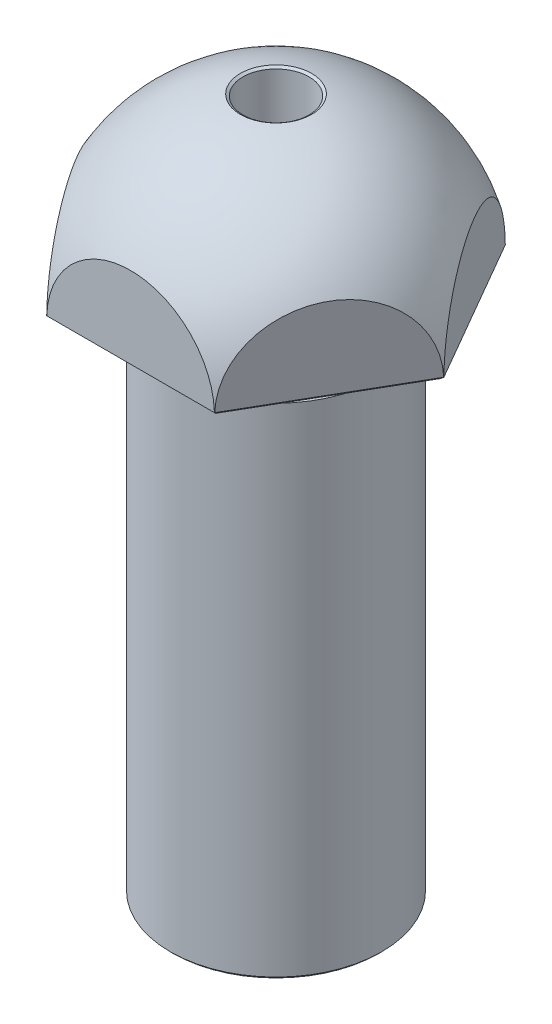
ISO-10303-21;
HEADER;
FILE_DESCRIPTION(('STEP AP214'),'2;1');
FILE_NAME('part.step','',(''),(''),'','','');
FILE_SCHEMA(('AUTOMOTIVE_DESIGN { 1 0 10303 214 1 1 1 1 }'));
ENDSEC;
DATA;
#1=APPLICATION_CONTEXT('core data for automotive mechanical design processes');
#2=APPLICATION_PROTOCOL_DEFINITION('international standard','automotive_design',2000,#1);
#3=PRODUCT_CONTEXT('',#1,'mechanical');
#4=PRODUCT('Part','Part','',(#3));
#5=PRODUCT_RELATED_PRODUCT_CATEGORY('part','',(#4));
#6=PRODUCT_DEFINITION_FORMATION('','',#4);
#7=PRODUCT_DEFINITION_CONTEXT('part definition',#1,'design');
#8=PRODUCT_DEFINITION('design','',#6,#7);
#9=PRODUCT_DEFINITION_SHAPE('','',#8);
#10=(LENGTH_UNIT() NAMED_UNIT(*) SI_UNIT(.MILLI.,.METRE.));
#11=(NAMED_UNIT(*) PLANE_ANGLE_UNIT() SI_UNIT($,.RADIAN.));
#12=(NAMED_UNIT(*) SI_UNIT($,.STERADIAN.) SOLID_ANGLE_UNIT());
#13=UNCERTAINTY_MEASURE_WITH_UNIT(LENGTH_MEASURE(1.E-05),#10,'distance_accuracy_value','');
#14=(GEOMETRIC_REPRESENTATION_CONTEXT(3) GLOBAL_UNCERTAINTY_ASSIGNED_CONTEXT((#13)) GLOBAL_UNIT_ASSIGNED_CONTEXT((#10,
#11,#12)) REPRESENTATION_CONTEXT('',''));
#15=CARTESIAN_POINT('',(0.,0.,0.));
#16=DIRECTION('',(0.,0.,1.));
#17=DIRECTION('',(1.,0.,0.));
#18=AXIS2_PLACEMENT_3D('',#15,#16,#17);
#19=CARTESIAN_POINT('',(0.,0.,0.));
#20=DIRECTION('',(0.,-1.,0.));
#21=DIRECTION('',(0.,0.,-1.));
#22=AXIS2_PLACEMENT_3D('',#19,#20,#21);
#23=CYLINDRICAL_SURFACE('',#22,2.49999999999999);
#24=CARTESIAN_POINT('',(0.,52.2816233799582,0.));
#25=DIRECTION('',(0.,1.,0.));
#26=DIRECTION('',(0.,0.,1.));
#27=AXIS2_PLACEMENT_3D('',#24,#25,#26);
#28=CIRCLE('',#27,2.49999999999999);
#29=CARTESIAN_POINT('',(0.,52.2816233799582,2.49999999999999));
#30=VERTEX_POINT('',#29);
#31=EDGE_CURVE('E142',#30,#30,#28,.T.);
#32=ORIENTED_EDGE('',*,*,#31,.T.);
#33=EDGE_LOOP('',(#32));
#34=FACE_BOUND('',#33,.T.);
#35=CARTESIAN_POINT('',(0.,27.,0.));
#36=DIRECTION('',(0.,-1.,0.));
#37=DIRECTION('',(0.,0.,-1.));
#38=AXIS2_PLACEMENT_3D('',#35,#36,#37);
#39=CIRCLE('',#38,2.49999999999999);
#40=CARTESIAN_POINT('',(0.,27.,-2.49999999999999));
#41=VERTEX_POINT('',#40);
#42=EDGE_CURVE('E11',#41,#41,#39,.F.);
#43=ORIENTED_EDGE('',*,*,#42,.F.);
#44=EDGE_LOOP('',(#43));
#45=FACE_BOUND('',#44,.T.);
#46=ADVANCED_FACE('F36',(#34,#45),#23,.F.);
#47=CARTESIAN_POINT('',(0.,0.,0.));
#48=DIRECTION('',(0.,-1.,0.));
#49=DIRECTION('',(0.,0.,-1.));
#50=AXIS2_PLACEMENT_3D('',#47,#48,#49);
#51=PLANE('',#50);
#52=CARTESIAN_POINT('',(0.,0.,0.));
#53=DIRECTION('',(0.,-1.,0.));
#54=DIRECTION('',(0.,0.,-1.));
#55=AXIS2_PLACEMENT_3D('',#52,#53,#54);
#56=CIRCLE('',#55,7.79999999999999);
#57=CARTESIAN_POINT('',(0.,0.,-7.79999999999999));
#58=VERTEX_POINT('',#57);
#59=EDGE_CURVE('E44',#58,#58,#56,.T.);
#60=ORIENTED_EDGE('',*,*,#59,.T.);
#61=EDGE_LOOP('',(#60));
#62=FACE_BOUND('',#61,.T.);
#63=ADVANCED_FACE('F265',(#62),#51,.T.);
#64=CARTESIAN_POINT('',(0.,0.,0.));
#65=DIRECTION('',(0.,-1.,0.));
#66=DIRECTION('',(0.,0.,-1.));
#67=AXIS2_PLACEMENT_3D('',#64,#65,#66);
#68=CYLINDRICAL_SURFACE('',#67,8.);
#69=CARTESIAN_POINT('',(0.,37.8,0.));
#70=DIRECTION('',(0.,1.,0.));
#71=DIRECTION('',(0.,0.,1.));
#72=AXIS2_PLACEMENT_3D('',#69,#70,#71);
#73=CIRCLE('',#72,8.);
#74=CARTESIAN_POINT('',(0.,37.8,8.));
#75=VERTEX_POINT('',#74);
#76=EDGE_CURVE('E199',#75,#75,#73,.F.);
#77=ORIENTED_EDGE('',*,*,#76,.T.);
#78=EDGE_LOOP('',(#77));
#79=FACE_BOUND('',#78,.T.);
#80=CARTESIAN_POINT('',(0.,0.200000000000006,0.));
#81=DIRECTION('',(0.,-1.,0.));
#82=DIRECTION('',(0.,0.,-1.));
#83=AXIS2_PLACEMENT_3D('',#80,#81,#82);
#84=CIRCLE('',#83,8.);
#85=CARTESIAN_POINT('',(0.,0.200000000000006,-8.));
#86=VERTEX_POINT('',#85);
#87=EDGE_CURVE('E134',#86,#86,#84,.F.);
#88=ORIENTED_EDGE('',*,*,#87,.T.);
#89=EDGE_LOOP('',(#88));
#90=FACE_BOUND('',#89,.T.);
#91=ADVANCED_FACE('F270',(#79,#90),#68,.T.);
#92=CARTESIAN_POINT('',(0.,39.,0.));
#93=DIRECTION('',(0.,-1.,0.));
#94=DIRECTION('',(0.,0.,-1.));
#95=AXIS2_PLACEMENT_3D('',#92,#93,#94);
#96=TOROIDAL_SURFACE('',#95,8.,1.);
#97=CARTESIAN_POINT('',(0.,38.0258342613227,0.));
#98=DIRECTION('',(0.,1.,0.));
#99=DIRECTION('',(0.,0.,1.));
#100=AXIS2_PLACEMENT_3D('',#97,#98,#99);
#101=CIRCLE('',#100,7.77416573867742);
#102=CARTESIAN_POINT('',(0.,38.0258342613227,7.77416573867742));
#103=VERTEX_POINT('',#102);
#104=EDGE_CURVE('E202',#103,#103,#101,.T.);
#105=ORIENTED_EDGE('',*,*,#104,.T.);
#106=EDGE_LOOP('',(#105));
#107=FACE_BOUND('',#106,.T.);
#108=CARTESIAN_POINT('',(0.,40.,0.));
#109=DIRECTION('',(0.,-1.,0.));
#110=DIRECTION('',(0.,0.,-1.));
#111=AXIS2_PLACEMENT_3D('',#108,#109,#110);
#112=CIRCLE('',#111,8.);
#113=CARTESIAN_POINT('',(0.,40.,-8.));
#114=VERTEX_POINT('',#113);
#115=EDGE_CURVE('E219',#114,#114,#112,.T.);
#116=ORIENTED_EDGE('',*,*,#115,.T.);
#117=EDGE_LOOP('',(#116));
#118=FACE_BOUND('',#117,.T.);
#119=ADVANCED_FACE('F300',(#107,#118),#96,.F.);
#120=CARTESIAN_POINT('',(8.,40.,0.));
#121=DIRECTION('',(0.,-1.,0.));
#122=DIRECTION('',(0.,0.,-1.));
#123=AXIS2_PLACEMENT_3D('',#120,#121,#122);
#124=PLANE('',#123);
#125=DIRECTION('',(1.,0.,0.));
#126=VECTOR('',#125,1.);
#127=CARTESIAN_POINT('',(6.34744042902334,40.,-10.8));
#128=LINE('',#127,#126);
#129=CARTESIAN_POINT('',(-6.23538290724795,40.,-10.8));
#130=VERTEX_POINT('',#129);
#131=CARTESIAN_POINT('',(6.23538290724795,40.,-10.8));
#132=VERTEX_POINT('',#131);
#133=EDGE_CURVE('E179',#130,#132,#128,.T.);
#134=ORIENTED_EDGE('',*,*,#133,.T.);
#135=DIRECTION('',(0.5,0.,0.866025403784439));
#136=VECTOR('',#135,1.);
#137=CARTESIAN_POINT('',(12.5267945753836,40.,0.097044660542604));
#138=LINE('',#137,#136);
#139=CARTESIAN_POINT('',(12.4707658144959,40.,0.));
#140=VERTEX_POINT('',#139);
#141=EDGE_CURVE('E188',#132,#140,#138,.T.);
#142=ORIENTED_EDGE('',*,*,#141,.T.);
#143=DIRECTION('',(-0.5,0.,0.866025403784439));
#144=VECTOR('',#143,1.);
#145=CARTESIAN_POINT('',(6.17935414636027,40.,10.8970446605426));
#146=LINE('',#145,#144);
#147=CARTESIAN_POINT('',(6.23538290724796,40.,10.8));
#148=VERTEX_POINT('',#147);
#149=EDGE_CURVE('E58',#140,#148,#146,.T.);
#150=ORIENTED_EDGE('',*,*,#149,.T.);
#151=DIRECTION('',(-1.,0.,0.));
#152=VECTOR('',#151,1.);
#153=CARTESIAN_POINT('',(-6.34744042902333,40.,10.8));
#154=LINE('',#153,#152);
#155=CARTESIAN_POINT('',(-6.23538290724795,40.,10.8));
#156=VERTEX_POINT('',#155);
#157=EDGE_CURVE('E185',#148,#156,#154,.T.);
#158=ORIENTED_EDGE('',*,*,#157,.T.);
#159=DIRECTION('',(-0.5,0.,-0.866025403784439));
#160=VECTOR('',#159,1.);
#161=CARTESIAN_POINT('',(-12.5267945753836,40.,-0.0970446605426159));
#162=LINE('',#161,#160);
#163=CARTESIAN_POINT('',(-12.4707658144959,40.,0.));
#164=VERTEX_POINT('',#163);
#165=EDGE_CURVE('E183',#156,#164,#162,.T.);
#166=ORIENTED_EDGE('',*,*,#165,.T.);
#167=DIRECTION('',(0.5,0.,-0.866025403784439));
#168=VECTOR('',#167,1.);
#169=CARTESIAN_POINT('',(-6.17935414636026,40.,-10.8970446605426));
#170=LINE('',#169,#168);
#171=EDGE_CURVE('E181',#164,#130,#170,.T.);
#172=ORIENTED_EDGE('',*,*,#171,.T.);
#173=EDGE_LOOP('',(#134,#142,#150,#158,#166,#172));
#174=FACE_BOUND('',#173,.T.);
#175=ORIENTED_EDGE('',*,*,#115,.F.);
#176=EDGE_LOOP('',(#175));
#177=FACE_BOUND('',#176,.T.);
#178=ADVANCED_FACE('F296',(#174,#177),#124,.T.);
#179=CARTESIAN_POINT('',(0.,40.,0.));
#180=DIRECTION('',(0.,-1.,0.));
#181=DIRECTION('',(1.,0.,0.));
#182=AXIS2_PLACEMENT_3D('',#179,#180,#181);
#183=SPHERICAL_SURFACE('',#182,12.7);
#184=CARTESIAN_POINT('',(0.,52.4109208506476,0.));
#185=DIRECTION('',(0.,-1.,0.));
#186=DIRECTION('',(0.,0.,-1.));
#187=AXIS2_PLACEMENT_3D('',#184,#185,#186);
#188=CIRCLE('',#187,2.69426124178065);
#189=CARTESIAN_POINT('',(0.,52.4109208506476,-2.69426124178065));
#190=VERTEX_POINT('',#189);
#191=EDGE_CURVE('E173',#190,#190,#188,.T.);
#192=ORIENTED_EDGE('',*,*,#191,.T.);
#193=EDGE_LOOP('',(#192));
#194=FACE_BOUND('',#193,.T.);
#195=CARTESIAN_POINT('',(4.67653718043587,34.6,2.69999999999995));
#196=DIRECTION('',(0.612372435695788,-0.707106781186555,0.35355339059327));
#197=DIRECTION('',(0.755928946018462,0.654653670707969,0.));
#198=AXIS2_PLACEMENT_3D('',#195,#196,#197);
#199=CIRCLE('',#198,10.1474134635384);
#200=CARTESIAN_POINT('',(12.6984238267412,40.2,0.00568475604103679));
#201=VERTEX_POINT('',#200);
#202=CARTESIAN_POINT('',(12.6984689417418,40.1971966927161,0.));
#203=VERTEX_POINT('',#202);
#204=EDGE_CURVE('E169',#201,#203,#199,.F.);
#205=ORIENTED_EDGE('',*,*,#204,.T.);
#206=CARTESIAN_POINT('',(4.67653718043586,34.6,-2.69999999999994));
#207=DIRECTION('',(0.612372435695787,-0.707106781186556,-0.35355339059327));
#208=DIRECTION('',(0.755928946018462,0.654653670707968,0.));
#209=AXIS2_PLACEMENT_3D('',#206,#207,#208);
#210=CIRCLE('',#209,10.1474134635384);
#211=CARTESIAN_POINT('',(12.6984238267412,40.2,-0.00568475604102725));
#212=VERTEX_POINT('',#211);
#213=EDGE_CURVE('E171',#203,#212,#210,.F.);
#214=ORIENTED_EDGE('',*,*,#213,.T.);
#215=CARTESIAN_POINT('',(9.52627944162883,40.,-5.5));
#216=DIRECTION('',(-0.866025403784439,0.,0.5));
#217=DIRECTION('',(0.5,0.,0.866025403784439));
#218=AXIS2_PLACEMENT_3D('',#215,#216,#217);
#219=CIRCLE('',#218,6.34744042902334);
#220=CARTESIAN_POINT('',(6.35413505651645,40.2,-10.994315243959));
#221=VERTEX_POINT('',#220);
#222=EDGE_CURVE('E224',#221,#212,#219,.F.);
#223=ORIENTED_EDGE('',*,*,#222,.F.);
#224=CARTESIAN_POINT('',(4.67653718043586,34.6,-2.69999999999994));
#225=DIRECTION('',(0.612372435695787,-0.707106781186556,-0.35355339059327));
#226=DIRECTION('',(0.755928946018462,0.654653670707968,0.));
#227=AXIS2_PLACEMENT_3D('',#224,#225,#226);
#228=CIRCLE('',#227,10.1474134635384);
#229=CARTESIAN_POINT('',(6.34923447087092,40.1971966927161,-10.9971966927161));
#230=VERTEX_POINT('',#229);
#231=EDGE_CURVE('E151',#221,#230,#228,.F.);
#232=ORIENTED_EDGE('',*,*,#231,.T.);
#233=CARTESIAN_POINT('',(0.,34.6,-5.40000000000005));
#234=DIRECTION('',(0.,-0.707106781186544,-0.707106781186551));
#235=DIRECTION('',(0.,0.707106781186551,-0.707106781186544));
#236=AXIS2_PLACEMENT_3D('',#233,#234,#235);
#237=CIRCLE('',#236,10.1474134635384);
#238=CARTESIAN_POINT('',(6.34428877022476,40.2,-11.));
#239=VERTEX_POINT('',#238);
#240=EDGE_CURVE('E141',#230,#239,#237,.F.);
#241=ORIENTED_EDGE('',*,*,#240,.T.);
#242=CARTESIAN_POINT('',(0.,40.,-11.));
#243=DIRECTION('',(0.,0.,1.));
#244=DIRECTION('',(1.,0.,0.));
#245=AXIS2_PLACEMENT_3D('',#242,#243,#244);
#246=CIRCLE('',#245,6.34744042902334);
#247=CARTESIAN_POINT('',(-6.34428877022476,40.2,-11.));
#248=VERTEX_POINT('',#247);
#249=EDGE_CURVE('E130',#248,#239,#246,.F.);
#250=ORIENTED_EDGE('',*,*,#249,.F.);
#251=CARTESIAN_POINT('',(0.,34.6,-5.40000000000005));
#252=DIRECTION('',(0.,-0.707106781186544,-0.707106781186551));
#253=DIRECTION('',(0.,0.707106781186551,-0.707106781186544));
#254=AXIS2_PLACEMENT_3D('',#251,#252,#253);
#255=CIRCLE('',#254,10.1474134635384);
#256=CARTESIAN_POINT('',(-6.34923447087091,40.1971966927161,-10.9971966927161));
#257=VERTEX_POINT('',#256);
#258=EDGE_CURVE('E139',#248,#257,#255,.F.);
#259=ORIENTED_EDGE('',*,*,#258,.T.);
#260=CARTESIAN_POINT('',(-4.67653718043586,34.6,-2.69999999999994));
#261=DIRECTION('',(-0.612372435695788,-0.707106781186555,-0.35355339059327));
#262=DIRECTION('',(0.755928946018462,-0.654653670707969,0.));
#263=AXIS2_PLACEMENT_3D('',#260,#261,#262);
#264=CIRCLE('',#263,10.1474134635384);
#265=CARTESIAN_POINT('',(-6.35413505651644,40.2,-10.994315243959));
#266=VERTEX_POINT('',#265);
#267=EDGE_CURVE('E150',#257,#266,#264,.F.);
#268=ORIENTED_EDGE('',*,*,#267,.T.);
#269=CARTESIAN_POINT('',(-9.52627944162882,40.,-5.5));
#270=DIRECTION('',(0.866025403784438,0.,0.5));
#271=DIRECTION('',(0.5,0.,-0.866025403784439));
#272=AXIS2_PLACEMENT_3D('',#269,#270,#271);
#273=CIRCLE('',#272,6.34744042902334);
#274=CARTESIAN_POINT('',(-12.6984238267412,40.2,-0.00568475604102638));
#275=VERTEX_POINT('',#274);
#276=EDGE_CURVE('E143',#275,#266,#273,.F.);
#277=ORIENTED_EDGE('',*,*,#276,.F.);
#278=CARTESIAN_POINT('',(-4.67653718043586,34.6,-2.69999999999994));
#279=DIRECTION('',(-0.612372435695788,-0.707106781186555,-0.35355339059327));
#280=DIRECTION('',(0.755928946018462,-0.654653670707969,0.));
#281=AXIS2_PLACEMENT_3D('',#278,#279,#280);
#282=CIRCLE('',#281,10.1474134635384);
#283=CARTESIAN_POINT('',(-12.6984689417418,40.1971966927161,0.));
#284=VERTEX_POINT('',#283);
#285=EDGE_CURVE('E153',#275,#284,#282,.F.);
#286=ORIENTED_EDGE('',*,*,#285,.T.);
#287=CARTESIAN_POINT('',(-4.67653718043593,34.6,2.69999999999998));
#288=DIRECTION('',(-0.612372435695792,-0.707106781186551,0.353553390593272));
#289=DIRECTION('',(0.755928946018457,-0.654653670707974,0.));
#290=AXIS2_PLACEMENT_3D('',#287,#288,#289);
#291=CIRCLE('',#290,10.1474134635384);
#292=CARTESIAN_POINT('',(-12.6984238267412,40.2,0.00568475604101164));
#293=VERTEX_POINT('',#292);
#294=EDGE_CURVE('E159',#284,#293,#291,.F.);
#295=ORIENTED_EDGE('',*,*,#294,.T.);
#296=CARTESIAN_POINT('',(-9.52627944162882,40.,5.5));
#297=DIRECTION('',(0.866025403784439,0.,-0.5));
#298=DIRECTION('',(-0.5,0.,-0.866025403784439));
#299=AXIS2_PLACEMENT_3D('',#296,#297,#298);
#300=CIRCLE('',#299,6.34744042902335);
#301=CARTESIAN_POINT('',(-6.35413505651644,40.2,10.994315243959));
#302=VERTEX_POINT('',#301);
#303=EDGE_CURVE('E237',#302,#293,#300,.F.);
#304=ORIENTED_EDGE('',*,*,#303,.F.);
#305=CARTESIAN_POINT('',(-4.67653718043593,34.6,2.69999999999998));
#306=DIRECTION('',(-0.612372435695792,-0.707106781186551,0.353553390593272));
#307=DIRECTION('',(0.755928946018457,-0.654653670707974,0.));
#308=AXIS2_PLACEMENT_3D('',#305,#306,#307);
#309=CIRCLE('',#308,10.1474134635384);
#310=CARTESIAN_POINT('',(-6.34923447087091,40.1971966927161,10.9971966927161));
#311=VERTEX_POINT('',#310);
#312=EDGE_CURVE('E161',#302,#311,#309,.F.);
#313=ORIENTED_EDGE('',*,*,#312,.T.);
#314=CARTESIAN_POINT('',(0.,34.6,5.4));
#315=DIRECTION('',(0.,-0.707106781186548,0.707106781186548));
#316=DIRECTION('',(0.,-0.707106781186548,-0.707106781186548));
#317=AXIS2_PLACEMENT_3D('',#314,#315,#316);
#318=CIRCLE('',#317,10.1474134635384);
#319=CARTESIAN_POINT('',(-6.34428877022475,40.2,11.));
#320=VERTEX_POINT('',#319);
#321=EDGE_CURVE('E163',#311,#320,#318,.F.);
#322=ORIENTED_EDGE('',*,*,#321,.T.);
#323=CARTESIAN_POINT('',(0.,40.,11.));
#324=DIRECTION('',(0.,0.,-1.));
#325=DIRECTION('',(-1.,0.,0.));
#326=AXIS2_PLACEMENT_3D('',#323,#324,#325);
#327=CIRCLE('',#326,6.34744042902333);
#328=CARTESIAN_POINT('',(6.34428877022475,40.2,11.));
#329=VERTEX_POINT('',#328);
#330=EDGE_CURVE('E234',#329,#320,#327,.F.);
#331=ORIENTED_EDGE('',*,*,#330,.F.);
#332=CARTESIAN_POINT('',(0.,34.6,5.4));
#333=DIRECTION('',(0.,-0.707106781186548,0.707106781186548));
#334=DIRECTION('',(0.,-0.707106781186548,-0.707106781186548));
#335=AXIS2_PLACEMENT_3D('',#332,#333,#334);
#336=CIRCLE('',#335,10.1474134635384);
#337=CARTESIAN_POINT('',(6.34923447087091,40.1971966927161,10.9971966927161));
#338=VERTEX_POINT('',#337);
#339=EDGE_CURVE('E165',#329,#338,#336,.F.);
#340=ORIENTED_EDGE('',*,*,#339,.T.);
#341=CARTESIAN_POINT('',(4.67653718043587,34.6,2.69999999999995));
#342=DIRECTION('',(0.612372435695788,-0.707106781186555,0.35355339059327));
#343=DIRECTION('',(0.755928946018462,0.654653670707969,0.));
#344=AXIS2_PLACEMENT_3D('',#341,#342,#343);
#345=CIRCLE('',#344,10.1474134635384);
#346=CARTESIAN_POINT('',(6.35413505651645,40.2,10.994315243959));
#347=VERTEX_POINT('',#346);
#348=EDGE_CURVE('E167',#338,#347,#345,.F.);
#349=ORIENTED_EDGE('',*,*,#348,.T.);
#350=CARTESIAN_POINT('',(9.52627944162883,40.,5.50000000000001));
#351=DIRECTION('',(-0.866025403784438,0.,-0.5));
#352=DIRECTION('',(-0.5,0.,0.866025403784439));
#353=AXIS2_PLACEMENT_3D('',#350,#351,#352);
#354=CIRCLE('',#353,6.34744042902333);
#355=EDGE_CURVE('E229',#201,#347,#354,.F.);
#356=ORIENTED_EDGE('',*,*,#355,.F.);
#357=EDGE_LOOP('',(#205,#214,#223,#232,#241,#250,#259,#268,#277,#286,#295,#304,#313,#322,#331,
#340,#349,#356));
#358=FACE_BOUND('',#357,.T.);
#359=ADVANCED_FACE('F138',(#194,#358),#183,.T.);
#360=CARTESIAN_POINT('',(12.7017059221718,50.,0.));
#361=DIRECTION('',(-0.866025403784439,0.,0.5));
#362=DIRECTION('',(0.5,0.,0.866025403784439));
#363=AXIS2_PLACEMENT_3D('',#360,#361,#362);
#364=PLANE('',#363);
#365=ORIENTED_EDGE('',*,*,#222,.T.);
#366=DIRECTION('',(-0.5,0.,-0.866025403784439));
#367=VECTOR('',#366,1.);
#368=CARTESIAN_POINT('',(6.35255922711716,40.2,-10.9970446605426));
#369=LINE('',#368,#367);
#370=EDGE_CURVE('E176',#212,#221,#369,.T.);
#371=ORIENTED_EDGE('',*,*,#370,.T.);
#372=EDGE_LOOP('',(#365,#371));
#373=FACE_BOUND('',#372,.T.);
#374=ADVANCED_FACE('F275',(#373),#364,.F.);
#375=CARTESIAN_POINT('',(6.35085296108589,50.,11.));
#376=DIRECTION('',(-0.866025403784438,0.,-0.5));
#377=DIRECTION('',(-0.5,0.,0.866025403784439));
#378=AXIS2_PLACEMENT_3D('',#375,#376,#377);
#379=PLANE('',#378);
#380=ORIENTED_EDGE('',*,*,#355,.T.);
#381=DIRECTION('',(0.5,0.,-0.866025403784439));
#382=VECTOR('',#381,1.);
#383=CARTESIAN_POINT('',(12.6999996561405,40.2,0.00295533945740686));
#384=LINE('',#383,#382);
#385=EDGE_CURVE('E190',#347,#201,#384,.T.);
#386=ORIENTED_EDGE('',*,*,#385,.T.);
#387=EDGE_LOOP('',(#380,#386));
#388=FACE_BOUND('',#387,.T.);
#389=ADVANCED_FACE('F278',(#388),#379,.F.);
#390=CARTESIAN_POINT('',(-6.35085296108588,50.,11.));
#391=DIRECTION('',(0.,0.,-1.));
#392=DIRECTION('',(-1.,0.,0.));
#393=AXIS2_PLACEMENT_3D('',#390,#391,#392);
#394=PLANE('',#393);
#395=ORIENTED_EDGE('',*,*,#330,.T.);
#396=DIRECTION('',(1.,0.,0.));
#397=VECTOR('',#396,1.);
#398=CARTESIAN_POINT('',(6.34744042902333,40.2,11.));
#399=LINE('',#398,#397);
#400=EDGE_CURVE('E192',#320,#329,#399,.T.);
#401=ORIENTED_EDGE('',*,*,#400,.T.);
#402=EDGE_LOOP('',(#395,#401));
#403=FACE_BOUND('',#402,.T.);
#404=ADVANCED_FACE('F282',(#403),#394,.F.);
#405=CARTESIAN_POINT('',(-12.7017059221718,50.,0.));
#406=DIRECTION('',(0.866025403784439,0.,-0.5));
#407=DIRECTION('',(-0.5,0.,-0.866025403784439));
#408=AXIS2_PLACEMENT_3D('',#405,#406,#407);
#409=PLANE('',#408);
#410=ORIENTED_EDGE('',*,*,#303,.T.);
#411=DIRECTION('',(0.5,0.,0.866025403784439));
#412=VECTOR('',#411,1.);
#413=CARTESIAN_POINT('',(-6.35255922711715,40.2,10.9970446605426));
#414=LINE('',#413,#412);
#415=EDGE_CURVE('E194',#293,#302,#414,.T.);
#416=ORIENTED_EDGE('',*,*,#415,.T.);
#417=EDGE_LOOP('',(#410,#416));
#418=FACE_BOUND('',#417,.T.);
#419=ADVANCED_FACE('F286',(#418),#409,.F.);
#420=CARTESIAN_POINT('',(-6.35085296108588,50.,-11.));
#421=DIRECTION('',(0.866025403784438,0.,0.5));
#422=DIRECTION('',(0.5,0.,-0.866025403784439));
#423=AXIS2_PLACEMENT_3D('',#420,#421,#422);
#424=PLANE('',#423);
#425=ORIENTED_EDGE('',*,*,#276,.T.);
#426=DIRECTION('',(-0.5,0.,0.866025403784439));
#427=VECTOR('',#426,1.);
#428=CARTESIAN_POINT('',(-12.6999996561405,40.2,-0.00295533945739474));
#429=LINE('',#428,#427);
#430=EDGE_CURVE('E135',#266,#275,#429,.T.);
#431=ORIENTED_EDGE('',*,*,#430,.T.);
#432=EDGE_LOOP('',(#425,#431));
#433=FACE_BOUND('',#432,.T.);
#434=ADVANCED_FACE('F259',(#433),#424,.F.);
#435=CARTESIAN_POINT('',(6.35085296108589,50.,-11.));
#436=DIRECTION('',(0.,0.,1.));
#437=DIRECTION('',(1.,0.,0.));
#438=AXIS2_PLACEMENT_3D('',#435,#436,#437);
#439=PLANE('',#438);
#440=ORIENTED_EDGE('',*,*,#249,.T.);
#441=DIRECTION('',(-1.,0.,0.));
#442=VECTOR('',#441,1.);
#443=CARTESIAN_POINT('',(-6.34744042902334,40.2,-11.));
#444=LINE('',#443,#442);
#445=EDGE_CURVE('E127',#239,#248,#444,.T.);
#446=ORIENTED_EDGE('',*,*,#445,.T.);
#447=EDGE_LOOP('',(#440,#446));
#448=FACE_BOUND('',#447,.T.);
#449=ADVANCED_FACE('F129',(#448),#439,.F.);
#450=CARTESIAN_POINT('',(0.,52.2816233799582,0.));
#451=DIRECTION('',(0.,1.,0.));
#452=DIRECTION('',(0.,0.,1.));
#453=AXIS2_PLACEMENT_3D('',#450,#451,#452);
#454=CONICAL_SURFACE('',#453,2.49999999999999,0.983542579143578);
#455=ORIENTED_EDGE('',*,*,#191,.F.);
#456=EDGE_LOOP('',(#455));
#457=FACE_BOUND('',#456,.T.);
#458=ORIENTED_EDGE('',*,*,#31,.F.);
#459=EDGE_LOOP('',(#458));
#460=FACE_BOUND('',#459,.T.);
#461=ADVANCED_FACE('F247',(#457,#460),#454,.F.);
#462=CARTESIAN_POINT('',(-12.7017059221718,40.2,0.));
#463=DIRECTION('',(-0.612372435695792,-0.707106781186551,0.353553390593272));
#464=DIRECTION('',(-0.5,0.,-0.866025403784439));
#465=AXIS2_PLACEMENT_3D('',#462,#463,#464);
#466=PLANE('',#465);
#467=DIRECTION('',(-0.75592894601846,0.654653670707971,0.));
#468=VECTOR('',#467,1.);
#469=CARTESIAN_POINT('',(-9.07264708726557,37.0571428571429,0.));
#470=LINE('',#469,#468);
#471=EDGE_CURVE('E215',#164,#284,#470,.T.);
#472=ORIENTED_EDGE('',*,*,#471,.F.);
#473=ORIENTED_EDGE('',*,*,#165,.F.);
#474=DIRECTION('',(-0.377964473009233,0.654653670707976,0.654653670707976));
#475=VECTOR('',#474,1.);
#476=CARTESIAN_POINT('',(-4.53632354363276,37.0571428571429,7.8571428571429));
#477=LINE('',#476,#475);
#478=EDGE_CURVE('E217',#311,#156,#477,.F.);
#479=ORIENTED_EDGE('',*,*,#478,.F.);
#480=ORIENTED_EDGE('',*,*,#312,.F.);
#481=ORIENTED_EDGE('',*,*,#415,.F.);
#482=ORIENTED_EDGE('',*,*,#294,.F.);
#483=EDGE_LOOP('',(#472,#473,#479,#480,#481,#482));
#484=FACE_BOUND('',#483,.T.);
#485=ADVANCED_FACE('F249',(#484),#466,.T.);
#486=CARTESIAN_POINT('',(-6.35085296108588,40.2,11.));
#487=DIRECTION('',(0.,-0.707106781186548,0.707106781186548));
#488=DIRECTION('',(-1.,0.,0.));
#489=AXIS2_PLACEMENT_3D('',#486,#487,#488);
#490=PLANE('',#489);
#491=ORIENTED_EDGE('',*,*,#478,.T.);
#492=ORIENTED_EDGE('',*,*,#157,.F.);
#493=DIRECTION('',(0.377964473009241,0.654653670707973,0.654653670707973));
#494=VECTOR('',#493,1.);
#495=CARTESIAN_POINT('',(4.53632354363264,37.0571428571428,7.85714285714277));
#496=LINE('',#495,#494);
#497=EDGE_CURVE('E212',#338,#148,#496,.F.);
#498=ORIENTED_EDGE('',*,*,#497,.F.);
#499=ORIENTED_EDGE('',*,*,#339,.F.);
#500=ORIENTED_EDGE('',*,*,#400,.F.);
#501=ORIENTED_EDGE('',*,*,#321,.F.);
#502=EDGE_LOOP('',(#491,#492,#498,#499,#500,#501));
#503=FACE_BOUND('',#502,.T.);
#504=ADVANCED_FACE('F256',(#503),#490,.T.);
#505=CARTESIAN_POINT('',(-6.35085296108588,40.2,-11.));
#506=DIRECTION('',(-0.612372435695788,-0.707106781186555,-0.35355339059327));
#507=DIRECTION('',(0.5,0.,-0.866025403784439));
#508=AXIS2_PLACEMENT_3D('',#505,#506,#507);
#509=PLANE('',#508);
#510=ORIENTED_EDGE('',*,*,#430,.F.);
#511=ORIENTED_EDGE('',*,*,#267,.F.);
#512=DIRECTION('',(-0.377964473009246,0.654653670707975,-0.654653670707969));
#513=VECTOR('',#512,1.);
#514=CARTESIAN_POINT('',(-4.53632354363259,37.0571428571427,-7.85714285714274));
#515=LINE('',#514,#513);
#516=EDGE_CURVE('E149',#130,#257,#515,.T.);
#517=ORIENTED_EDGE('',*,*,#516,.F.);
#518=ORIENTED_EDGE('',*,*,#171,.F.);
#519=ORIENTED_EDGE('',*,*,#471,.T.);
#520=ORIENTED_EDGE('',*,*,#285,.F.);
#521=EDGE_LOOP('',(#510,#511,#517,#518,#519,#520));
#522=FACE_BOUND('',#521,.T.);
#523=ADVANCED_FACE('F331',(#522),#509,.T.);
#524=CARTESIAN_POINT('',(6.35085296108589,40.2,11.));
#525=DIRECTION('',(0.612372435695788,-0.707106781186555,0.35355339059327));
#526=DIRECTION('',(-0.5,0.,0.866025403784439));
#527=AXIS2_PLACEMENT_3D('',#524,#525,#526);
#528=PLANE('',#527);
#529=ORIENTED_EDGE('',*,*,#497,.T.);
#530=ORIENTED_EDGE('',*,*,#149,.F.);
#531=DIRECTION('',(0.755928946018462,0.654653670707969,0.));
#532=VECTOR('',#531,1.);
#533=CARTESIAN_POINT('',(9.07264708726547,37.0571428571428,0.));
#534=LINE('',#533,#532);
#535=EDGE_CURVE('E51',#203,#140,#534,.F.);
#536=ORIENTED_EDGE('',*,*,#535,.F.);
#537=ORIENTED_EDGE('',*,*,#204,.F.);
#538=ORIENTED_EDGE('',*,*,#385,.F.);
#539=ORIENTED_EDGE('',*,*,#348,.F.);
#540=EDGE_LOOP('',(#529,#530,#536,#537,#538,#539));
#541=FACE_BOUND('',#540,.T.);
#542=ADVANCED_FACE('F334',(#541),#528,.T.);
#543=CARTESIAN_POINT('',(6.35085296108589,40.2,-11.));
#544=DIRECTION('',(0.,-0.707106781186544,-0.707106781186551));
#545=DIRECTION('',(1.,0.,0.));
#546=AXIS2_PLACEMENT_3D('',#543,#544,#545);
#547=PLANE('',#546);
#548=ORIENTED_EDGE('',*,*,#445,.F.);
#549=ORIENTED_EDGE('',*,*,#240,.F.);
#550=DIRECTION('',(0.377964473009247,0.654653670707975,-0.654653670707968));
#551=VECTOR('',#550,1.);
#552=CARTESIAN_POINT('',(4.53632354363277,37.057142857143,-7.85714285714305));
#553=LINE('',#552,#551);
#554=EDGE_CURVE('E207',#132,#230,#553,.T.);
#555=ORIENTED_EDGE('',*,*,#554,.F.);
#556=ORIENTED_EDGE('',*,*,#133,.F.);
#557=ORIENTED_EDGE('',*,*,#516,.T.);
#558=ORIENTED_EDGE('',*,*,#258,.F.);
#559=EDGE_LOOP('',(#548,#549,#555,#556,#557,#558));
#560=FACE_BOUND('',#559,.T.);
#561=ADVANCED_FACE('F146',(#560),#547,.T.);
#562=CARTESIAN_POINT('',(12.7017059221718,40.2,0.));
#563=DIRECTION('',(0.612372435695787,-0.707106781186556,-0.35355339059327));
#564=DIRECTION('',(0.5,0.,0.866025403784439));
#565=AXIS2_PLACEMENT_3D('',#562,#563,#564);
#566=PLANE('',#565);
#567=ORIENTED_EDGE('',*,*,#535,.T.);
#568=ORIENTED_EDGE('',*,*,#141,.F.);
#569=ORIENTED_EDGE('',*,*,#554,.T.);
#570=ORIENTED_EDGE('',*,*,#231,.F.);
#571=ORIENTED_EDGE('',*,*,#370,.F.);
#572=ORIENTED_EDGE('',*,*,#213,.F.);
#573=EDGE_LOOP('',(#567,#568,#569,#570,#571,#572));
#574=FACE_BOUND('',#573,.T.);
#575=ADVANCED_FACE('F321',(#574),#566,.T.);
#576=CARTESIAN_POINT('',(0.,37.8,0.));
#577=DIRECTION('',(0.,-1.,0.));
#578=DIRECTION('',(0.,0.,-1.));
#579=AXIS2_PLACEMENT_3D('',#576,#577,#578);
#580=CONICAL_SURFACE('',#579,8.,0.785398163397439);
#581=ORIENTED_EDGE('',*,*,#104,.F.);
#582=EDGE_LOOP('',(#581));
#583=FACE_BOUND('',#582,.T.);
#584=ORIENTED_EDGE('',*,*,#76,.F.);
#585=EDGE_LOOP('',(#584));
#586=FACE_BOUND('',#585,.T.);
#587=ADVANCED_FACE('F314',(#583,#586),#580,.T.);
#588=CARTESIAN_POINT('',(0.,0.,0.));
#589=DIRECTION('',(0.,1.,0.));
#590=DIRECTION('',(0.,0.,1.));
#591=AXIS2_PLACEMENT_3D('',#588,#589,#590);
#592=CONICAL_SURFACE('',#591,7.79999999999999,0.785398163397448);
#593=ORIENTED_EDGE('',*,*,#87,.F.);
#594=EDGE_LOOP('',(#593));
#595=FACE_BOUND('',#594,.T.);
#596=ORIENTED_EDGE('',*,*,#59,.F.);
#597=EDGE_LOOP('',(#596));
#598=FACE_BOUND('',#597,.T.);
#599=ADVANCED_FACE('F38',(#595,#598),#592,.T.);
#600=CARTESIAN_POINT('',(0.,27.,0.));
#601=DIRECTION('',(0.,-1.,0.));
#602=DIRECTION('',(0.,0.,-1.));
#603=AXIS2_PLACEMENT_3D('',#600,#601,#602);
#604=PLANE('',#603);
#605=ORIENTED_EDGE('',*,*,#42,.T.);
#606=EDGE_LOOP('',(#605));
#607=FACE_BOUND('',#606,.T.);
#608=ADVANCED_FACE('F274',(#607),#604,.F.);
#609=CLOSED_SHELL('',(#46,#63,#91,#119,#178,#359,#374,#389,#404,#419,#434,#449,#461,#485,#504,
#523,#542,#561,#575,#587,#599,#608));
#610=MANIFOLD_SOLID_BREP('B2',#609);
#611=ADVANCED_BREP_SHAPE_REPRESENTATION('',(#18,#610),#14);
#612=SHAPE_DEFINITION_REPRESENTATION(#9,#611);
ENDSEC;
END-ISO-10303-21;
